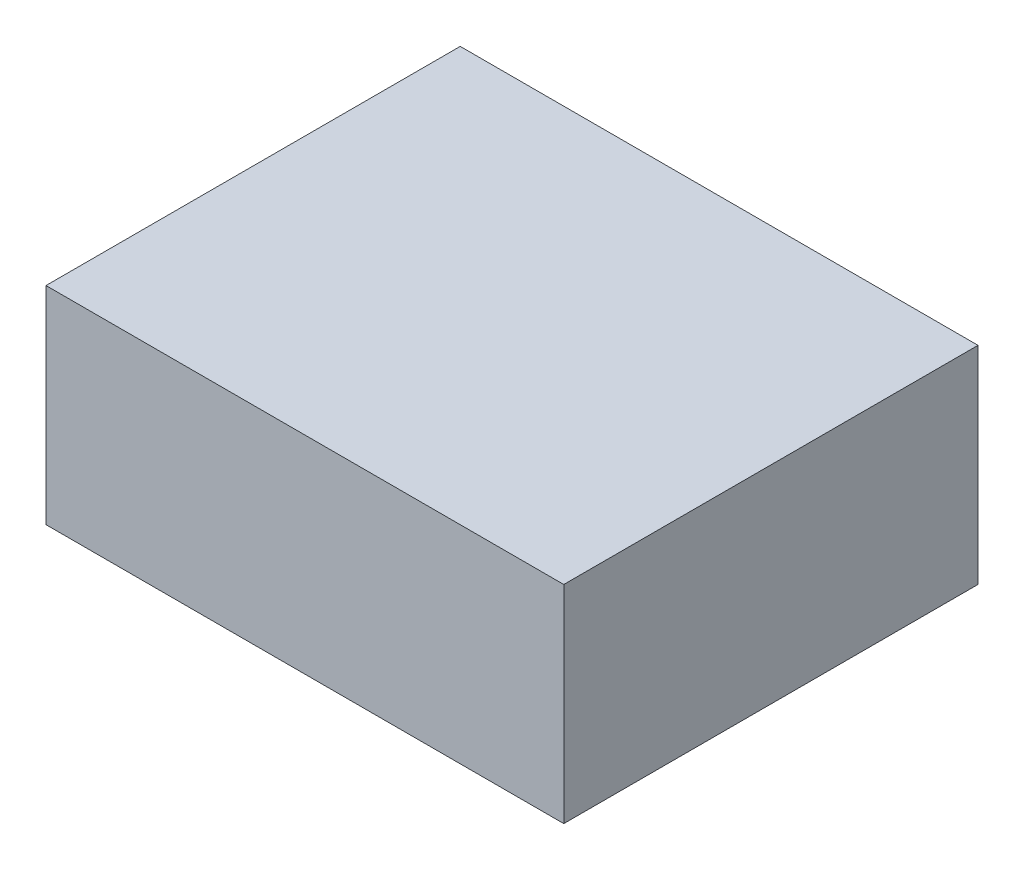
ISO-10303-21;
HEADER;
FILE_DESCRIPTION(('STEP AP214'),'2;1');
FILE_NAME('part.step','',(''),(''),'','','');
FILE_SCHEMA(('AUTOMOTIVE_DESIGN { 1 0 10303 214 1 1 1 1 }'));
ENDSEC;
DATA;
#1=APPLICATION_CONTEXT('core data for automotive mechanical design processes');
#2=APPLICATION_PROTOCOL_DEFINITION('international standard','automotive_design',2000,#1);
#3=PRODUCT_CONTEXT('',#1,'mechanical');
#4=PRODUCT('Part','Part','',(#3));
#5=PRODUCT_RELATED_PRODUCT_CATEGORY('part','',(#4));
#6=PRODUCT_DEFINITION_FORMATION('','',#4);
#7=PRODUCT_DEFINITION_CONTEXT('part definition',#1,'design');
#8=PRODUCT_DEFINITION('design','',#6,#7);
#9=PRODUCT_DEFINITION_SHAPE('','',#8);
#10=(LENGTH_UNIT() NAMED_UNIT(*) SI_UNIT(.MILLI.,.METRE.));
#11=(NAMED_UNIT(*) PLANE_ANGLE_UNIT() SI_UNIT($,.RADIAN.));
#12=(NAMED_UNIT(*) SI_UNIT($,.STERADIAN.) SOLID_ANGLE_UNIT());
#13=UNCERTAINTY_MEASURE_WITH_UNIT(LENGTH_MEASURE(1.E-05),#10,'distance_accuracy_value','');
#14=(GEOMETRIC_REPRESENTATION_CONTEXT(3) GLOBAL_UNCERTAINTY_ASSIGNED_CONTEXT((#13)) GLOBAL_UNIT_ASSIGNED_CONTEXT((#10,
#11,#12)) REPRESENTATION_CONTEXT('',''));
#15=CARTESIAN_POINT('',(0.,0.,0.));
#16=DIRECTION('',(0.,0.,1.));
#17=DIRECTION('',(1.,0.,0.));
#18=AXIS2_PLACEMENT_3D('',#15,#16,#17);
#19=CARTESIAN_POINT('',(0.499999,-0.1999996,0.));
#20=DIRECTION('',(0.,-1.,0.));
#21=DIRECTION('',(0.,0.,-1.));
#22=AXIS2_PLACEMENT_3D('',#19,#20,#21);
#23=PLANE('',#22);
#24=DIRECTION('',(0.,0.,1.));
#25=VECTOR('',#24,1.);
#26=CARTESIAN_POINT('',(-0.499999,-0.1999996,0.));
#27=LINE('',#26,#25);
#28=CARTESIAN_POINT('',(-0.499999,-0.1999996,0.));
#29=VERTEX_POINT('',#28);
#30=CARTESIAN_POINT('',(-0.499999,-0.1999996,0.80000094));
#31=VERTEX_POINT('',#30);
#32=EDGE_CURVE('E20',#29,#31,#27,.T.);
#33=ORIENTED_EDGE('',*,*,#32,.F.);
#34=DIRECTION('',(1.,0.,0.));
#35=VECTOR('',#34,1.);
#36=CARTESIAN_POINT('',(-0.499999,-0.1999996,0.));
#37=LINE('',#36,#35);
#38=CARTESIAN_POINT('',(0.499999,-0.1999996,0.));
#39=VERTEX_POINT('',#38);
#40=EDGE_CURVE('E79',#29,#39,#37,.T.);
#41=ORIENTED_EDGE('',*,*,#40,.T.);
#42=DIRECTION('',(0.,0.,-1.));
#43=VECTOR('',#42,1.);
#44=CARTESIAN_POINT('',(0.499999,-0.1999996,0.));
#45=LINE('',#44,#43);
#46=CARTESIAN_POINT('',(0.499999,-0.1999996,0.80000094));
#47=VERTEX_POINT('',#46);
#48=EDGE_CURVE('E61',#47,#39,#45,.T.);
#49=ORIENTED_EDGE('',*,*,#48,.F.);
#50=DIRECTION('',(1.,0.,0.));
#51=VECTOR('',#50,1.);
#52=CARTESIAN_POINT('',(-0.499999,-0.1999996,0.80000094));
#53=LINE('',#52,#51);
#54=EDGE_CURVE('E56',#31,#47,#53,.T.);
#55=ORIENTED_EDGE('',*,*,#54,.F.);
#56=EDGE_LOOP('',(#33,#41,#49,#55));
#57=FACE_BOUND('',#56,.T.);
#58=ADVANCED_FACE('F17',(#57),#23,.T.);
#59=CARTESIAN_POINT('',(-0.499999,-0.1999996,0.));
#60=DIRECTION('',(-1.,0.,0.));
#61=DIRECTION('',(0.,0.,1.));
#62=AXIS2_PLACEMENT_3D('',#59,#60,#61);
#63=PLANE('',#62);
#64=DIRECTION('',(0.,0.,1.));
#65=VECTOR('',#64,1.);
#66=CARTESIAN_POINT('',(-0.499999,0.20000214,0.));
#67=LINE('',#66,#65);
#68=CARTESIAN_POINT('',(-0.499999,0.20000214,0.));
#69=VERTEX_POINT('',#68);
#70=CARTESIAN_POINT('',(-0.499999,0.20000214,0.80000094));
#71=VERTEX_POINT('',#70);
#72=EDGE_CURVE('E83',#69,#71,#67,.T.);
#73=ORIENTED_EDGE('',*,*,#72,.F.);
#74=DIRECTION('',(0.,1.,0.));
#75=VECTOR('',#74,1.);
#76=CARTESIAN_POINT('',(-0.499999,-0.1999996,0.));
#77=LINE('',#76,#75);
#78=EDGE_CURVE('E68',#69,#29,#77,.F.);
#79=ORIENTED_EDGE('',*,*,#78,.T.);
#80=ORIENTED_EDGE('',*,*,#32,.T.);
#81=DIRECTION('',(0.,1.,0.));
#82=VECTOR('',#81,1.);
#83=CARTESIAN_POINT('',(-0.499999,-0.1999996,0.80000094));
#84=LINE('',#83,#82);
#85=EDGE_CURVE('E63',#71,#31,#84,.F.);
#86=ORIENTED_EDGE('',*,*,#85,.F.);
#87=EDGE_LOOP('',(#73,#79,#80,#86));
#88=FACE_BOUND('',#87,.T.);
#89=ADVANCED_FACE('F65',(#88),#63,.T.);
#90=CARTESIAN_POINT('',(-0.499999,-0.1999996,0.80000094));
#91=DIRECTION('',(0.,0.,1.));
#92=DIRECTION('',(1.,0.,0.));
#93=AXIS2_PLACEMENT_3D('',#90,#91,#92);
#94=PLANE('',#93);
#95=DIRECTION('',(1.,0.,0.));
#96=VECTOR('',#95,1.);
#97=CARTESIAN_POINT('',(-0.499999,0.20000214,0.80000094));
#98=LINE('',#97,#96);
#99=CARTESIAN_POINT('',(0.499999,0.20000214,0.80000094));
#100=VERTEX_POINT('',#99);
#101=EDGE_CURVE('E72',#71,#100,#98,.T.);
#102=ORIENTED_EDGE('',*,*,#101,.F.);
#103=ORIENTED_EDGE('',*,*,#85,.T.);
#104=ORIENTED_EDGE('',*,*,#54,.T.);
#105=DIRECTION('',(0.,1.,0.));
#106=VECTOR('',#105,1.);
#107=CARTESIAN_POINT('',(0.499999,0.20000214,0.80000094));
#108=LINE('',#107,#106);
#109=EDGE_CURVE('E74',#100,#47,#108,.F.);
#110=ORIENTED_EDGE('',*,*,#109,.F.);
#111=EDGE_LOOP('',(#102,#103,#104,#110));
#112=FACE_BOUND('',#111,.T.);
#113=ADVANCED_FACE('F70',(#112),#94,.T.);
#114=CARTESIAN_POINT('',(0.499999,0.20000214,0.));
#115=DIRECTION('',(1.,0.,0.));
#116=DIRECTION('',(0.,0.,-1.));
#117=AXIS2_PLACEMENT_3D('',#114,#115,#116);
#118=PLANE('',#117);
#119=ORIENTED_EDGE('',*,*,#48,.T.);
#120=DIRECTION('',(0.,1.,0.));
#121=VECTOR('',#120,1.);
#122=CARTESIAN_POINT('',(0.499999,-0.1999996,0.));
#123=LINE('',#122,#121);
#124=CARTESIAN_POINT('',(0.499999,0.20000214,0.));
#125=VERTEX_POINT('',#124);
#126=EDGE_CURVE('E35',#39,#125,#123,.T.);
#127=ORIENTED_EDGE('',*,*,#126,.T.);
#128=DIRECTION('',(0.,0.,1.));
#129=VECTOR('',#128,1.);
#130=CARTESIAN_POINT('',(0.499999,0.20000214,0.));
#131=LINE('',#130,#129);
#132=EDGE_CURVE('E26',#100,#125,#131,.F.);
#133=ORIENTED_EDGE('',*,*,#132,.F.);
#134=ORIENTED_EDGE('',*,*,#109,.T.);
#135=EDGE_LOOP('',(#119,#127,#133,#134));
#136=FACE_BOUND('',#135,.T.);
#137=ADVANCED_FACE('F89',(#136),#118,.T.);
#138=CARTESIAN_POINT('',(-0.499999,-0.1999996,0.));
#139=DIRECTION('',(0.,0.,1.));
#140=DIRECTION('',(1.,0.,0.));
#141=AXIS2_PLACEMENT_3D('',#138,#139,#140);
#142=PLANE('',#141);
#143=DIRECTION('',(1.,0.,0.));
#144=VECTOR('',#143,1.);
#145=CARTESIAN_POINT('',(-0.499999,0.20000214,0.));
#146=LINE('',#145,#144);
#147=EDGE_CURVE('E11',#125,#69,#146,.F.);
#148=ORIENTED_EDGE('',*,*,#147,.F.);
#149=ORIENTED_EDGE('',*,*,#126,.F.);
#150=ORIENTED_EDGE('',*,*,#40,.F.);
#151=ORIENTED_EDGE('',*,*,#78,.F.);
#152=EDGE_LOOP('',(#148,#149,#150,#151));
#153=FACE_BOUND('',#152,.T.);
#154=ADVANCED_FACE('F91',(#153),#142,.F.);
#155=CARTESIAN_POINT('',(-0.499999,0.20000214,0.));
#156=DIRECTION('',(0.,1.,0.));
#157=DIRECTION('',(0.,0.,1.));
#158=AXIS2_PLACEMENT_3D('',#155,#156,#157);
#159=PLANE('',#158);
#160=ORIENTED_EDGE('',*,*,#132,.T.);
#161=ORIENTED_EDGE('',*,*,#147,.T.);
#162=ORIENTED_EDGE('',*,*,#72,.T.);
#163=ORIENTED_EDGE('',*,*,#101,.T.);
#164=EDGE_LOOP('',(#160,#161,#162,#163));
#165=FACE_BOUND('',#164,.T.);
#166=ADVANCED_FACE('F88',(#165),#159,.T.);
#167=CLOSED_SHELL('',(#58,#89,#113,#137,#154,#166));
#168=MANIFOLD_SOLID_BREP('B1',#167);
#169=ADVANCED_BREP_SHAPE_REPRESENTATION('',(#18,#168),#14);
#170=SHAPE_DEFINITION_REPRESENTATION(#9,#169);
ENDSEC;
END-ISO-10303-21;
